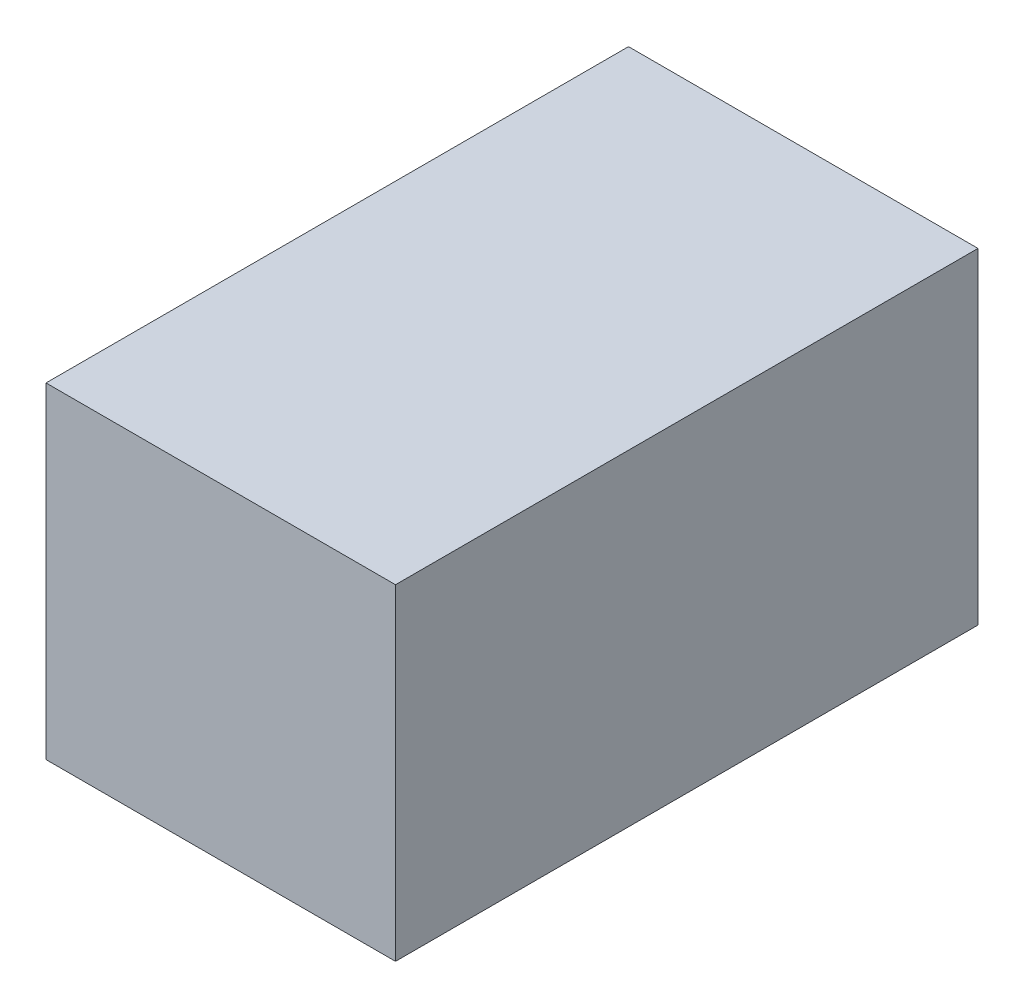
ISO-10303-21;
HEADER;
FILE_DESCRIPTION(('STEP AP214'),'2;1');
FILE_NAME('part.step','',(''),(''),'','','');
FILE_SCHEMA(('AUTOMOTIVE_DESIGN { 1 0 10303 214 1 1 1 1 }'));
ENDSEC;
DATA;
#1=APPLICATION_CONTEXT('core data for automotive mechanical design processes');
#2=APPLICATION_PROTOCOL_DEFINITION('international standard','automotive_design',2000,#1);
#3=PRODUCT_CONTEXT('',#1,'mechanical');
#4=PRODUCT('Part','Part','',(#3));
#5=PRODUCT_RELATED_PRODUCT_CATEGORY('part','',(#4));
#6=PRODUCT_DEFINITION_FORMATION('','',#4);
#7=PRODUCT_DEFINITION_CONTEXT('part definition',#1,'design');
#8=PRODUCT_DEFINITION('design','',#6,#7);
#9=PRODUCT_DEFINITION_SHAPE('','',#8);
#10=(LENGTH_UNIT() NAMED_UNIT(*) SI_UNIT(.MILLI.,.METRE.));
#11=(NAMED_UNIT(*) PLANE_ANGLE_UNIT() SI_UNIT($,.RADIAN.));
#12=(NAMED_UNIT(*) SI_UNIT($,.STERADIAN.) SOLID_ANGLE_UNIT());
#13=UNCERTAINTY_MEASURE_WITH_UNIT(LENGTH_MEASURE(1.E-05),#10,'distance_accuracy_value','');
#14=(GEOMETRIC_REPRESENTATION_CONTEXT(3) GLOBAL_UNCERTAINTY_ASSIGNED_CONTEXT((#13)) GLOBAL_UNIT_ASSIGNED_CONTEXT((#10,
#11,#12)) REPRESENTATION_CONTEXT('',''));
#15=CARTESIAN_POINT('',(0.,0.,0.));
#16=DIRECTION('',(0.,0.,1.));
#17=DIRECTION('',(1.,0.,0.));
#18=AXIS2_PLACEMENT_3D('',#15,#16,#17);
#19=CARTESIAN_POINT('',(0.,-2.8,5.));
#20=DIRECTION('',(1.,0.,0.));
#21=DIRECTION('',(0.,0.,-1.));
#22=AXIS2_PLACEMENT_3D('',#19,#20,#21);
#23=PLANE('',#22);
#24=DIRECTION('',(0.,-1.,0.));
#25=VECTOR('',#24,1.);
#26=CARTESIAN_POINT('',(0.,-2.8,0.));
#27=LINE('',#26,#25);
#28=CARTESIAN_POINT('',(0.,0.,0.));
#29=VERTEX_POINT('',#28);
#30=CARTESIAN_POINT('',(0.,-2.8,0.));
#31=VERTEX_POINT('',#30);
#32=EDGE_CURVE('E96',#29,#31,#27,.T.);
#33=ORIENTED_EDGE('',*,*,#32,.T.);
#34=DIRECTION('',(0.,0.,-1.));
#35=VECTOR('',#34,1.);
#36=CARTESIAN_POINT('',(0.,-2.8,5.));
#37=LINE('',#36,#35);
#38=CARTESIAN_POINT('',(0.,-2.8,5.));
#39=VERTEX_POINT('',#38);
#40=EDGE_CURVE('E11',#39,#31,#37,.T.);
#41=ORIENTED_EDGE('',*,*,#40,.F.);
#42=DIRECTION('',(0.,-1.,0.));
#43=VECTOR('',#42,1.);
#44=CARTESIAN_POINT('',(0.,-2.8,5.));
#45=LINE('',#44,#43);
#46=CARTESIAN_POINT('',(0.,0.,5.));
#47=VERTEX_POINT('',#46);
#48=EDGE_CURVE('E84',#47,#39,#45,.T.);
#49=ORIENTED_EDGE('',*,*,#48,.F.);
#50=DIRECTION('',(0.,0.,-1.));
#51=VECTOR('',#50,1.);
#52=CARTESIAN_POINT('',(0.,0.,5.));
#53=LINE('',#52,#51);
#54=EDGE_CURVE('E92',#47,#29,#53,.T.);
#55=ORIENTED_EDGE('',*,*,#54,.T.);
#56=EDGE_LOOP('',(#33,#41,#49,#55));
#57=FACE_BOUND('',#56,.T.);
#58=ADVANCED_FACE('F33',(#57),#23,.F.);
#59=CARTESIAN_POINT('',(3.,-2.8,5.));
#60=DIRECTION('',(0.,1.,0.));
#61=DIRECTION('',(0.,0.,1.));
#62=AXIS2_PLACEMENT_3D('',#59,#60,#61);
#63=PLANE('',#62);
#64=DIRECTION('',(1.,0.,0.));
#65=VECTOR('',#64,1.);
#66=CARTESIAN_POINT('',(3.,-2.8,0.));
#67=LINE('',#66,#65);
#68=CARTESIAN_POINT('',(3.,-2.8,0.));
#69=VERTEX_POINT('',#68);
#70=EDGE_CURVE('E88',#31,#69,#67,.T.);
#71=ORIENTED_EDGE('',*,*,#70,.T.);
#72=DIRECTION('',(0.,0.,-1.));
#73=VECTOR('',#72,1.);
#74=CARTESIAN_POINT('',(3.,-2.8,5.));
#75=LINE('',#74,#73);
#76=CARTESIAN_POINT('',(3.,-2.8,5.));
#77=VERTEX_POINT('',#76);
#78=EDGE_CURVE('E41',#77,#69,#75,.T.);
#79=ORIENTED_EDGE('',*,*,#78,.F.);
#80=DIRECTION('',(1.,0.,0.));
#81=VECTOR('',#80,1.);
#82=CARTESIAN_POINT('',(3.,-2.8,5.));
#83=LINE('',#82,#81);
#84=EDGE_CURVE('E79',#39,#77,#83,.T.);
#85=ORIENTED_EDGE('',*,*,#84,.F.);
#86=ORIENTED_EDGE('',*,*,#40,.T.);
#87=EDGE_LOOP('',(#71,#79,#85,#86));
#88=FACE_BOUND('',#87,.T.);
#89=ADVANCED_FACE('F87',(#88),#63,.F.);
#90=CARTESIAN_POINT('',(3.,0.,5.));
#91=DIRECTION('',(-1.,0.,0.));
#92=DIRECTION('',(0.,-1.,0.));
#93=AXIS2_PLACEMENT_3D('',#90,#91,#92);
#94=PLANE('',#93);
#95=DIRECTION('',(0.,1.,0.));
#96=VECTOR('',#95,1.);
#97=CARTESIAN_POINT('',(3.,0.,0.));
#98=LINE('',#97,#96);
#99=CARTESIAN_POINT('',(3.,0.,0.));
#100=VERTEX_POINT('',#99);
#101=EDGE_CURVE('E66',#69,#100,#98,.T.);
#102=ORIENTED_EDGE('',*,*,#101,.T.);
#103=DIRECTION('',(0.,0.,-1.));
#104=VECTOR('',#103,1.);
#105=CARTESIAN_POINT('',(3.,0.,5.));
#106=LINE('',#105,#104);
#107=CARTESIAN_POINT('',(3.,0.,5.));
#108=VERTEX_POINT('',#107);
#109=EDGE_CURVE('E89',#108,#100,#106,.T.);
#110=ORIENTED_EDGE('',*,*,#109,.F.);
#111=DIRECTION('',(0.,1.,0.));
#112=VECTOR('',#111,1.);
#113=CARTESIAN_POINT('',(3.,0.,5.));
#114=LINE('',#113,#112);
#115=EDGE_CURVE('E82',#77,#108,#114,.T.);
#116=ORIENTED_EDGE('',*,*,#115,.F.);
#117=ORIENTED_EDGE('',*,*,#78,.T.);
#118=EDGE_LOOP('',(#102,#110,#116,#117));
#119=FACE_BOUND('',#118,.T.);
#120=ADVANCED_FACE('F90',(#119),#94,.F.);
#121=CARTESIAN_POINT('',(0.,0.,5.));
#122=DIRECTION('',(0.,-1.,0.));
#123=DIRECTION('',(0.,0.,-1.));
#124=AXIS2_PLACEMENT_3D('',#121,#122,#123);
#125=PLANE('',#124);
#126=DIRECTION('',(-1.,0.,0.));
#127=VECTOR('',#126,1.);
#128=CARTESIAN_POINT('',(0.,0.,0.));
#129=LINE('',#128,#127);
#130=EDGE_CURVE('E72',#100,#29,#129,.T.);
#131=ORIENTED_EDGE('',*,*,#130,.T.);
#132=ORIENTED_EDGE('',*,*,#54,.F.);
#133=DIRECTION('',(-1.,0.,0.));
#134=VECTOR('',#133,1.);
#135=CARTESIAN_POINT('',(0.,0.,5.));
#136=LINE('',#135,#134);
#137=EDGE_CURVE('E49',#108,#47,#136,.T.);
#138=ORIENTED_EDGE('',*,*,#137,.F.);
#139=ORIENTED_EDGE('',*,*,#109,.T.);
#140=EDGE_LOOP('',(#131,#132,#138,#139));
#141=FACE_BOUND('',#140,.T.);
#142=ADVANCED_FACE('F103',(#141),#125,.F.);
#143=CARTESIAN_POINT('',(0.,0.,5.));
#144=DIRECTION('',(0.,0.,-1.));
#145=DIRECTION('',(-1.,0.,0.));
#146=AXIS2_PLACEMENT_3D('',#143,#144,#145);
#147=PLANE('',#146);
#148=ORIENTED_EDGE('',*,*,#48,.T.);
#149=ORIENTED_EDGE('',*,*,#84,.T.);
#150=ORIENTED_EDGE('',*,*,#115,.T.);
#151=ORIENTED_EDGE('',*,*,#137,.T.);
#152=EDGE_LOOP('',(#148,#149,#150,#151));
#153=FACE_BOUND('',#152,.T.);
#154=ADVANCED_FACE('F80',(#153),#147,.F.);
#155=CARTESIAN_POINT('',(0.,0.,0.));
#156=DIRECTION('',(0.,0.,-1.));
#157=DIRECTION('',(-1.,0.,0.));
#158=AXIS2_PLACEMENT_3D('',#155,#156,#157);
#159=PLANE('',#158);
#160=ORIENTED_EDGE('',*,*,#32,.F.);
#161=ORIENTED_EDGE('',*,*,#130,.F.);
#162=ORIENTED_EDGE('',*,*,#101,.F.);
#163=ORIENTED_EDGE('',*,*,#70,.F.);
#164=EDGE_LOOP('',(#160,#161,#162,#163));
#165=FACE_BOUND('',#164,.T.);
#166=ADVANCED_FACE('F106',(#165),#159,.T.);
#167=CLOSED_SHELL('',(#58,#89,#120,#142,#154,#166));
#168=MANIFOLD_SOLID_BREP('B2',#167);
#169=ADVANCED_BREP_SHAPE_REPRESENTATION('',(#18,#168),#14);
#170=SHAPE_DEFINITION_REPRESENTATION(#9,#169);
ENDSEC;
END-ISO-10303-21;
